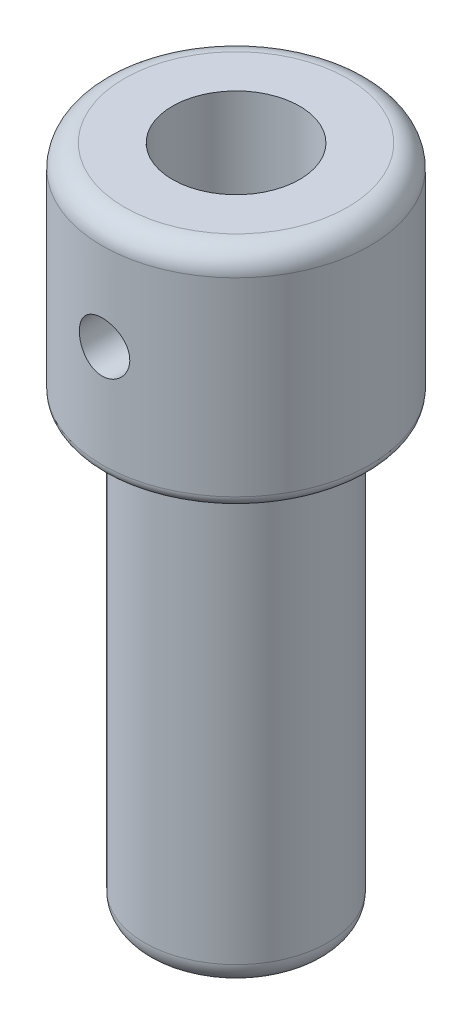
ISO-10303-21;
HEADER;
FILE_DESCRIPTION(('STEP AP214'),'2;1');
FILE_NAME('part.step','',(''),(''),'','','');
FILE_SCHEMA(('AUTOMOTIVE_DESIGN { 1 0 10303 214 1 1 1 1 }'));
ENDSEC;
DATA;
#1=APPLICATION_CONTEXT('core data for automotive mechanical design processes');
#2=APPLICATION_PROTOCOL_DEFINITION('international standard','automotive_design',2000,#1);
#3=PRODUCT_CONTEXT('',#1,'mechanical');
#4=PRODUCT('Part','Part','',(#3));
#5=PRODUCT_RELATED_PRODUCT_CATEGORY('part','',(#4));
#6=PRODUCT_DEFINITION_FORMATION('','',#4);
#7=PRODUCT_DEFINITION_CONTEXT('part definition',#1,'design');
#8=PRODUCT_DEFINITION('design','',#6,#7);
#9=PRODUCT_DEFINITION_SHAPE('','',#8);
#10=(LENGTH_UNIT() NAMED_UNIT(*) SI_UNIT(.MILLI.,.METRE.));
#11=(NAMED_UNIT(*) PLANE_ANGLE_UNIT() SI_UNIT($,.RADIAN.));
#12=(NAMED_UNIT(*) SI_UNIT($,.STERADIAN.) SOLID_ANGLE_UNIT());
#13=UNCERTAINTY_MEASURE_WITH_UNIT(LENGTH_MEASURE(1.E-05),#10,'distance_accuracy_value','');
#14=(GEOMETRIC_REPRESENTATION_CONTEXT(3) GLOBAL_UNCERTAINTY_ASSIGNED_CONTEXT((#13)) GLOBAL_UNIT_ASSIGNED_CONTEXT((#10,
#11,#12)) REPRESENTATION_CONTEXT('',''));
#15=CARTESIAN_POINT('',(0.,0.,0.));
#16=DIRECTION('',(0.,0.,1.));
#17=DIRECTION('',(1.,0.,0.));
#18=AXIS2_PLACEMENT_3D('',#15,#16,#17);
#19=CARTESIAN_POINT('',(0.,27.8833911171361,0.));
#20=DIRECTION('',(0.,1.,0.));
#21=DIRECTION('',(0.,0.,1.));
#22=AXIS2_PLACEMENT_3D('',#19,#20,#21);
#23=CYLINDRICAL_SURFACE('',#22,2.85);
#24=CARTESIAN_POINT('',(-1.1303,14.207956767553,-2.61628016657238));
#25=CARTESIAN_POINT('',(-1.13029345260006,14.1473595204045,-2.61628615758823));
#26=CARTESIAN_POINT('',(-1.12539796176125,14.0866739034662,-2.61841514923867));
#27=CARTESIAN_POINT('',(-1.10599719074433,13.9670406354449,-2.62666594018558));
#28=CARTESIAN_POINT('',(-1.09146710256743,13.9080978823915,-2.6327980464167));
#29=CARTESIAN_POINT('',(-1.05343662185008,13.7938825794678,-2.64824238541049));
#30=CARTESIAN_POINT('',(-1.02996966626684,13.7385972397041,-2.65754275073175));
#31=CARTESIAN_POINT('',(-0.974829067334243,13.6327616551994,-2.67825916114637));
#32=CARTESIAN_POINT('',(-0.94315731912611,13.5822103206651,-2.68967471750022));
#33=CARTESIAN_POINT('',(-0.870601296688737,13.4844066845974,-2.71405390199821));
#34=CARTESIAN_POINT('',(-0.829329791113889,13.4374537938542,-2.7270667752228));
#35=CARTESIAN_POINT('',(-0.739561241593753,13.3509176408861,-2.75276724838696));
#36=CARTESIAN_POINT('',(-0.691061705224281,13.3113369314261,-2.76545473434818));
#37=CARTESIAN_POINT('',(-0.585909079825502,13.2391909526268,-2.78966447553969));
#38=CARTESIAN_POINT('',(-0.529013276820995,13.2069560226321,-2.8011227276858));
#39=CARTESIAN_POINT('',(-0.41007101493985,13.1526421046209,-2.82098725876858));
#40=CARTESIAN_POINT('',(-0.348026630169997,13.1305590501424,-2.82939475943749));
#41=CARTESIAN_POINT('',(-0.223686802608242,13.0982408707284,-2.84186198756307));
#42=CARTESIAN_POINT('',(-0.161544393671202,13.0874910195282,-2.84610991073926));
#43=CARTESIAN_POINT('',(-0.0362022464437598,13.0764880962844,-2.85045890481045));
#44=CARTESIAN_POINT('',(0.0269970959328641,13.0762311780876,-2.8505614951646));
#45=CARTESIAN_POINT('',(0.14894280191952,13.0859367570211,-2.84672351510987));
#46=CARTESIAN_POINT('',(0.207742312429826,13.0953355759219,-2.84300595278716));
#47=CARTESIAN_POINT('',(0.32285017960443,13.1231285359758,-2.83224484413563));
#48=CARTESIAN_POINT('',(0.3791583534036,13.1415233362471,-2.82520105410183));
#49=CARTESIAN_POINT('',(0.488695083264103,13.1870129935552,-2.8083441160034));
#50=CARTESIAN_POINT('',(0.541864694625503,13.2142343511411,-2.79849096893217));
#51=CARTESIAN_POINT('',(0.643017939138199,13.2764868543251,-2.77699583915126));
#52=CARTESIAN_POINT('',(0.690999799633604,13.3115206569933,-2.7653532482582));
#53=CARTESIAN_POINT('',(0.78370941836785,13.3910453789027,-2.74057463765392));
#54=CARTESIAN_POINT('',(0.828026032225194,13.4360013875532,-2.72739072968969));
#55=CARTESIAN_POINT('',(0.908657773160785,13.5327626317893,-2.70159898880295));
#56=CARTESIAN_POINT('',(0.944970370584533,13.5845700244885,-2.6889913390008));
#57=CARTESIAN_POINT('',(1.00948153094452,13.6953712470871,-2.66545716991748));
#58=CARTESIAN_POINT('',(1.03743089233395,13.7545229246783,-2.65458608854393));
#59=CARTESIAN_POINT('',(1.08280941269767,13.8772392112616,-2.63640446660756));
#60=CARTESIAN_POINT('',(1.10024526707809,13.9408009829121,-2.62909166057208));
#61=CARTESIAN_POINT('',(1.12311075281383,14.0664365467872,-2.61940226123772));
#62=CARTESIAN_POINT('',(1.12920096451842,14.1283689457052,-2.61675460292483));
#63=CARTESIAN_POINT('',(1.13112604573816,14.2524138581021,-2.61592366023471));
#64=CARTESIAN_POINT('',(1.1269639435527,14.3145263129834,-2.61773905757246));
#65=CARTESIAN_POINT('',(1.10910367875456,14.4335397960088,-2.62535187637376));
#66=CARTESIAN_POINT('',(1.09594845961356,14.490538589223,-2.63092233882755));
#67=CARTESIAN_POINT('',(1.06117676870925,14.6014837463882,-2.6451378155093));
#68=CARTESIAN_POINT('',(1.03955844072125,14.6554294377254,-2.65378350419259));
#69=CARTESIAN_POINT('',(0.987503826129682,14.7611520661867,-2.67360042278488));
#70=CARTESIAN_POINT('',(0.956748280498782,14.8127549044529,-2.68485913351115));
#71=CARTESIAN_POINT('',(0.887620450132167,14.9102991539487,-2.70849826092059));
#72=CARTESIAN_POINT('',(0.84924510507705,14.9562382784211,-2.7208791272026));
#73=CARTESIAN_POINT('',(0.762686752231697,15.0446063215062,-2.74644975347201));
#74=CARTESIAN_POINT('',(0.71399490741265,15.0865404986826,-2.75963319912947));
#75=CARTESIAN_POINT('',(0.60994913624833,15.1617170350298,-2.78447828685408));
#76=CARTESIAN_POINT('',(0.55459497766097,15.1949590910729,-2.79613987584115));
#77=CARTESIAN_POINT('',(0.438636092047854,15.2516696894494,-2.81665729228926));
#78=CARTESIAN_POINT('',(0.378035304647506,15.2751454895477,-2.82551520212132));
#79=CARTESIAN_POINT('',(0.253307736784389,15.3114173331386,-2.83941250920415));
#80=CARTESIAN_POINT('',(0.189182853172556,15.3242190631049,-2.84445393950337));
#81=CARTESIAN_POINT('',(0.0636733211525488,15.3381123855514,-2.84993634234282));
#82=CARTESIAN_POINT('',(0.00237755620106384,15.3399039324471,-2.85065224962834));
#83=CARTESIAN_POINT('',(-0.119610230778455,15.3335677659018,-2.84814205272999));
#84=CARTESIAN_POINT('',(-0.180302340210167,15.3254415101812,-2.84491652785834));
#85=CARTESIAN_POINT('',(-0.29750802460962,15.2999997444868,-2.83502186178104));
#86=CARTESIAN_POINT('',(-0.354092223489288,15.2829653011713,-2.82845820866166));
#87=CARTESIAN_POINT('',(-0.463591313852398,15.2404837599666,-2.81258722939358));
#88=CARTESIAN_POINT('',(-0.51650552086019,15.2150350978517,-2.80327939312878));
#89=CARTESIAN_POINT('',(-0.619717100814278,15.1551857698337,-2.78232741592889));
#90=CARTESIAN_POINT('',(-0.669797290115329,15.1204408527963,-2.77059858084371));
#91=CARTESIAN_POINT('',(-0.763625088019747,15.0435037598042,-2.74622118141278));
#92=CARTESIAN_POINT('',(-0.807370126276554,15.0013085763923,-2.73357224686657));
#93=CARTESIAN_POINT('',(-0.890027710479454,14.90764427652,-2.70782897312818));
#94=CARTESIAN_POINT('',(-0.928486449468884,14.8557679882691,-2.69475412717537));
#95=CARTESIAN_POINT('',(-0.996182498280698,14.7458781476329,-2.67047181819971));
#96=CARTESIAN_POINT('',(-1.02541865937423,14.6878638319193,-2.65926458788181));
#97=CARTESIAN_POINT('',(-1.07150917231037,14.5725842768592,-2.64100887230388));
#98=CARTESIAN_POINT('',(-1.08923271334006,14.5157102864014,-2.63367939671218));
#99=CARTESIAN_POINT('',(-1.11550593728572,14.3996428704612,-2.62266224330814));
#100=CARTESIAN_POINT('',(-1.12408132532078,14.3404564310246,-2.61896436352176));
#101=CARTESIAN_POINT('',(-1.12951457954801,14.2566815834085,-2.61661869985514));
#102=CARTESIAN_POINT('',(-1.13030263307697,14.2323263214838,-2.61627775724868));
#103=CARTESIAN_POINT('',(-1.1303,14.207956767553,-2.61628016657238));
#104=B_SPLINE_CURVE_WITH_KNOTS('',3,(#24,#25,#26,#27,#28,#29,#30,#31,#32,#33,#34,#35,#36,#37,
#38,#39,#40,#41,#42,#43,#44,#45,#46,#47,#48,#49,#50,#51,#52,#53,#54,#55,#56,#57,#58,#59,#60,#61,
#62,#63,#64,#65,#66,#67,#68,#69,#70,#71,#72,#73,#74,#75,#76,#77,#78,#79,#80,#81,#82,#83,#84,#85,
#86,#87,#88,#89,#90,#91,#92,#93,#94,#95,#96,#97,#98,#99,#100,#101,#102,#103),.UNSPECIFIED.,.T.,
.F.,(4,2,2,2,2,2,2,2,2,2,2,2,2,2,2,2,2,2,2,2,2,2,2,2,2,2,2,2,2,2,2,2,2,2,2,2,2,2,2,4),(0.,
0.181716975656185,0.363903678435025,0.545415328812845,0.726885090992661,0.917602857506357,
1.10838654158053,1.30654526536695,1.50462454486106,1.69325899335997,1.88182429784737,
2.05997433361122,2.23813742404032,2.41897598989032,2.5998761543283,2.7924757333061,
2.98513609601993,3.18306800972907,3.380873739278,3.56675171469447,3.75257479258605,
3.92806848698283,4.10360069422464,4.28618218572826,4.4688371558088,4.66471276259825,
4.86059519940866,5.05633180558367,5.2519640688501,5.43501870938735,5.61804644776521,
5.79561976198589,5.97322610613686,6.15863738337789,6.34412367762097,6.54085612157854,
6.73761306010636,6.91689183719345,7.09566552657978,7.16874412085215),.UNSPECIFIED.);
#105=CARTESIAN_POINT('',(-1.1303,14.207956767553,-2.61628016657238));
#106=VERTEX_POINT('',#105);
#107=EDGE_CURVE('E73',#106,#106,#104,.T.);
#108=ORIENTED_EDGE('',*,*,#107,.F.);
#109=EDGE_LOOP('',(#108));
#110=FACE_BOUND('',#109,.T.);
#111=CARTESIAN_POINT('',(0.,-10.867124799104,0.));
#112=DIRECTION('',(0.,1.,0.));
#113=DIRECTION('',(0.,0.,1.));
#114=AXIS2_PLACEMENT_3D('',#111,#112,#113);
#115=CIRCLE('',#114,2.85);
#116=CARTESIAN_POINT('',(0.,-10.867124799104,2.85));
#117=VERTEX_POINT('',#116);
#118=EDGE_CURVE('E108',#117,#117,#115,.T.);
#119=ORIENTED_EDGE('',*,*,#118,.F.);
#120=EDGE_LOOP('',(#119));
#121=FACE_BOUND('',#120,.T.);
#122=CARTESIAN_POINT('',(0.,19.132875200896,0.));
#123=DIRECTION('',(0.,1.,0.));
#124=DIRECTION('',(0.,0.,1.));
#125=AXIS2_PLACEMENT_3D('',#122,#123,#124);
#126=CIRCLE('',#125,2.85);
#127=CARTESIAN_POINT('',(0.,19.132875200896,2.85));
#128=VERTEX_POINT('',#127);
#129=EDGE_CURVE('E110',#128,#128,#126,.T.);
#130=ORIENTED_EDGE('',*,*,#129,.T.);
#131=EDGE_LOOP('',(#130));
#132=FACE_BOUND('',#131,.T.);
#133=CARTESIAN_POINT('',(0.,13.077656767553,2.85));
#134=CARTESIAN_POINT('',(-0.0608074901773255,13.0776630687484,2.84999540717361));
#135=CARTESIAN_POINT('',(-0.12170401895874,13.0825915473681,2.84803157332203));
#136=CARTESIAN_POINT('',(-0.241779075214386,13.1021356497798,2.84036715899765));
#137=CARTESIAN_POINT('',(-0.300952858364843,13.1167757885902,2.83465712243533));
#138=CARTESIAN_POINT('',(-0.415658505000918,13.1551273542757,2.82011680696815));
#139=CARTESIAN_POINT('',(-0.471201282705017,13.1788099791171,2.81129644180019));
#140=CARTESIAN_POINT('',(-0.577479497217421,13.2344600579773,2.79140546168017));
#141=CARTESIAN_POINT('',(-0.62821635410214,13.2664250541876,2.78033551450547));
#142=CARTESIAN_POINT('',(-0.725866365661877,13.3393010047808,2.75649249571009));
#143=CARTESIAN_POINT('',(-0.772526878206848,13.3805332681854,2.74366717826313));
#144=CARTESIAN_POINT('',(-0.858483167241851,13.470094799743,2.71799980493592));
#145=CARTESIAN_POINT('',(-0.897775506554412,13.5184273614564,2.70515774404384));
#146=CARTESIAN_POINT('',(-0.969566525464378,13.6233773587061,2.68028899841203));
#147=CARTESIAN_POINT('',(-1.00169441300704,13.6802640947794,2.66832225649654));
#148=CARTESIAN_POINT('',(-1.0558132335576,13.7991801942983,2.64737734758081));
#149=CARTESIAN_POINT('',(-1.07780886559612,13.8612071580833,2.63839779575096));
#150=CARTESIAN_POINT('',(-1.11002079402964,13.9857402025369,2.6250043082653));
#151=CARTESIAN_POINT('',(-1.12072037427083,14.048100503069,2.62040396433028));
#152=CARTESIAN_POINT('',(-1.1315463603039,14.1738879939961,2.61574868363865));
#153=CARTESIAN_POINT('',(-1.13167785075336,14.2373146566362,2.61569156098812));
#154=CARTESIAN_POINT('',(-1.12173064439811,14.3588222559069,2.61996991346858));
#155=CARTESIAN_POINT('',(-1.11234775729079,14.4169727303552,2.62400604190015));
#156=CARTESIAN_POINT('',(-1.08479694085289,14.5307937316849,2.63551439098454));
#157=CARTESIAN_POINT('',(-1.06662750678942,14.5864638320078,2.64298720017255));
#158=CARTESIAN_POINT('',(-1.02167561073786,14.6950731194098,2.66068984260431));
#159=CARTESIAN_POINT('',(-0.994726440319279,14.7479343384592,2.67097236187942));
#160=CARTESIAN_POINT('',(-0.933096972754285,14.8485761854745,2.69312093396432));
#161=CARTESIAN_POINT('',(-0.898413803098735,14.8963549159732,2.70498757447865));
#162=CARTESIAN_POINT('',(-0.819206791654082,14.9892904327284,2.73006423834238));
#163=CARTESIAN_POINT('',(-0.774135945835915,15.0339731846202,2.7433078729725));
#164=CARTESIAN_POINT('',(-0.676997914315145,15.1152963093423,2.76887958021833));
#165=CARTESIAN_POINT('',(-0.624929385031422,15.151935134142,2.78120747630129));
#166=CARTESIAN_POINT('',(-0.513948433470195,15.2167382574043,2.8038581708288));
#167=CARTESIAN_POINT('',(-0.454924167479125,15.2447270810821,2.81413811310026));
#168=CARTESIAN_POINT('',(-0.332494133954596,15.2902156618742,2.83121151543585));
#169=CARTESIAN_POINT('',(-0.269090570769267,15.3077206537949,2.83800671526403));
#170=CARTESIAN_POINT('',(-0.143677420716787,15.330792602352,2.84702949040508));
#171=CARTESIAN_POINT('',(-0.0818025104643576,15.3369967802482,2.84950054106954));
#172=CARTESIAN_POINT('',(0.0421475010854392,15.3391689180957,2.85036151708329));
#173=CARTESIAN_POINT('',(0.104222547580404,15.3351394759652,2.84875247820882));
#174=CARTESIAN_POINT('',(0.223941293107055,15.3174295976768,2.84179365203397));
#175=CARTESIAN_POINT('',(0.281659786441459,15.3041816808885,2.83661160172229));
#176=CARTESIAN_POINT('',(0.394003182883948,15.2689967689373,2.82320107652625));
#177=CARTESIAN_POINT('',(0.448627686622372,15.247058654959,2.81497220938979));
#178=CARTESIAN_POINT('',(0.555103317684441,15.194401637323,2.79595702197941));
#179=CARTESIAN_POINT('',(0.606819310170456,15.1634356538699,2.78510044442673));
#180=CARTESIAN_POINT('',(0.704501711258952,15.0938766813523,2.76201026134428));
#181=CARTESIAN_POINT('',(0.750465825620841,15.0552806646456,2.74977611001727));
#182=CARTESIAN_POINT('',(0.838468771170681,14.9686173745911,2.72428045643214));
#183=CARTESIAN_POINT('',(0.880059076122483,14.92009790501,2.71100381933433));
#184=CARTESIAN_POINT('',(0.954614470450029,14.8165295800304,2.6856593144646));
#185=CARTESIAN_POINT('',(0.987578239910047,14.7614797273117,2.67359163184467));
#186=CARTESIAN_POINT('',(1.04412658812304,14.6456391985278,2.65202341673373));
#187=CARTESIAN_POINT('',(1.06762563693942,14.5848020554289,2.64254653258578));
#188=CARTESIAN_POINT('',(1.10386749904738,14.4595459869256,2.62761642025123));
#189=CARTESIAN_POINT('',(1.1166180626714,14.3951296781111,2.62216029320418));
#190=CARTESIAN_POINT('',(1.13026658953869,14.2694664556327,2.61630416042592));
#191=CARTESIAN_POINT('',(1.13194100449719,14.2083187574168,2.61557301861382));
#192=CARTESIAN_POINT('',(1.12542175708809,14.086657922589,2.61838469640648));
#193=CARTESIAN_POINT('',(1.11722929527908,14.0261447096793,2.62192699603758));
#194=CARTESIAN_POINT('',(1.09183901376176,13.9098368830376,2.63259656992956));
#195=CARTESIAN_POINT('',(1.07499725370773,13.8539503211319,2.63958168897616));
#196=CARTESIAN_POINT('',(1.03311689699473,13.7457726181341,2.6562520251346));
#197=CARTESIAN_POINT('',(1.00807612998347,13.6934824334756,2.66593795707553));
#198=CARTESIAN_POINT('',(0.948869921275455,13.5907574697891,2.6875996422432));
#199=CARTESIAN_POINT('',(0.914268215995947,13.5405952543372,2.69967397493624));
#200=CARTESIAN_POINT('',(0.837562587574521,13.4465421621369,2.72444704457689));
#201=CARTESIAN_POINT('',(0.795455976972472,13.4026535421028,2.73714600401612));
#202=CARTESIAN_POINT('',(0.701758941402807,13.3195438073351,2.76270453999705));
#203=CARTESIAN_POINT('',(0.6497364035738,13.2807952453674,2.77552322426576));
#204=CARTESIAN_POINT('',(0.539453232251982,13.2125834086442,2.79904653565289));
#205=CARTESIAN_POINT('',(0.481191822549223,13.183121291065,2.8097508992455));
#206=CARTESIAN_POINT('',(0.365238679776311,13.1366294573683,2.82705511944058));
#207=CARTESIAN_POINT('',(0.307927595281227,13.1187494402197,2.83392849184325));
#208=CARTESIAN_POINT('',(0.190996183608853,13.0923086550131,2.84419401296488));
#209=CARTESIAN_POINT('',(0.131382633374208,13.0837224184462,2.84759567402874));
#210=CARTESIAN_POINT('',(0.0477011594602018,13.0784095112854,2.8497020110239));
#211=CARTESIAN_POINT('',(0.0238574327439071,13.0776542953191,2.85000180196628));
#212=CARTESIAN_POINT('',(0.,13.077656767553,2.85));
#213=B_SPLINE_CURVE_WITH_KNOTS('',3,(#133,#134,#135,#136,#137,#138,#139,#140,#141,#142,#143,
#144,#145,#146,#147,#148,#149,#150,#151,#152,#153,#154,#155,#156,#157,#158,#159,#160,#161,#162,
#163,#164,#165,#166,#167,#168,#169,#170,#171,#172,#173,#174,#175,#176,#177,#178,#179,#180,#181,
#182,#183,#184,#185,#186,#187,#188,#189,#190,#191,#192,#193,#194,#195,#196,#197,#198,#199,#200,
#201,#202,#203,#204,#205,#206,#207,#208,#209,#210,#211,#212),.UNSPECIFIED.,.T.,.F.,(4,2,2,2,2,2,
2,2,2,2,2,2,2,2,2,2,2,2,2,2,2,2,2,2,2,2,2,2,2,2,2,2,2,2,2,2,2,2,2,4),(0.,0.18235103647887,
0.365164139898366,0.547399741978617,0.729581327129752,0.919471809889442,1.10945065544731,
1.30771063280494,1.50587857044083,1.69517432753335,1.88437900762991,2.06067832241764,
2.2370078398976,2.41690232727703,2.59686374145579,2.79048030117432,2.98413408924157,
3.18149147161195,3.37875022678966,3.56449421800991,3.75019106076687,3.92771585731982,
4.1052635166521,4.28821859506783,4.47124641738565,4.66615596565339,4.86109531892948,
5.0577587563263,5.25428026544829,5.43686454500736,5.61942661075088,5.79501290601742,
5.97064571821315,6.1562200901882,6.3418610491987,6.53927563570051,6.73671481215973,
6.91720057574005,7.09719047731524,7.16873474884971),.UNSPECIFIED.);
#214=CARTESIAN_POINT('',(0.,13.077656767553,2.85));
#215=VERTEX_POINT('',#214);
#216=EDGE_CURVE('E78',#215,#215,#213,.T.);
#217=ORIENTED_EDGE('',*,*,#216,.F.);
#218=EDGE_LOOP('',(#217));
#219=FACE_BOUND('',#218,.T.);
#220=ADVANCED_FACE('F33',(#110,#121,#132,#219),#23,.F.);
#221=CARTESIAN_POINT('',(0.,27.8833911171361,0.));
#222=DIRECTION('',(0.,1.,0.));
#223=DIRECTION('',(0.,0.,1.));
#224=AXIS2_PLACEMENT_3D('',#221,#222,#223);
#225=CYLINDRICAL_SURFACE('',#224,6.);
#226=CARTESIAN_POINT('',(-1.1303,14.207956767553,-5.89257345393335));
#227=CARTESIAN_POINT('',(-1.13029759371886,14.2708388443507,-5.89257467389349));
#228=CARTESIAN_POINT('',(-1.12503470923862,14.3337520765433,-5.89359094692568));
#229=CARTESIAN_POINT('',(-1.10413664888009,14.4578041412641,-5.89754110597075));
#230=CARTESIAN_POINT('',(-1.08849270845028,14.5189414288273,-5.90047661232925));
#231=CARTESIAN_POINT('',(-1.0473303443427,14.6376287420455,-5.90792124227976));
#232=CARTESIAN_POINT('',(-1.02182116166712,14.6951820664784,-5.91242889282098));
#233=CARTESIAN_POINT('',(-0.961676957570338,14.8051887388032,-5.92250816709464));
#234=CARTESIAN_POINT('',(-0.927042634263309,14.8576424764163,-5.92807970942562));
#235=CARTESIAN_POINT('',(-0.849167546629499,14.9566237480183,-5.93973717031582));
#236=CARTESIAN_POINT('',(-0.805834284110569,15.003077919844,-5.94582817339823));
#237=CARTESIAN_POINT('',(-0.71199129427523,15.0881021235051,-5.95779335599509));
#238=CARTESIAN_POINT('',(-0.661481094038662,15.1266716353767,-5.96366752118898));
#239=CARTESIAN_POINT('',(-0.55423589821718,15.195113034438,-5.97459166076109));
#240=CARTESIAN_POINT('',(-0.497455997167567,15.2249157155131,-5.97963494574712));
#241=CARTESIAN_POINT('',(-0.379584245485869,15.274531542122,-5.98827215676677));
#242=CARTESIAN_POINT('',(-0.318492753200837,15.29434551673,-5.99186620308392));
#243=CARTESIAN_POINT('',(-0.194492274556963,15.3231945274959,-5.99716407192991));
#244=CARTESIAN_POINT('',(-0.131613005230441,15.3323532491812,-5.99888956786352));
#245=CARTESIAN_POINT('',(-0.0051882759389024,15.3400171921361,-6.00033063220662));
#246=CARTESIAN_POINT('',(0.0583571263164807,15.3385233287865,-6.00004637331517));
#247=CARTESIAN_POINT('',(0.18346196079908,15.3250192931738,-5.99751688360689));
#248=CARTESIAN_POINT('',(0.245036343694403,15.3131423032652,-5.99529648816132));
#249=CARTESIAN_POINT('',(0.365302250254909,15.2794198393961,-5.98917207750207));
#250=CARTESIAN_POINT('',(0.423993668038547,15.2575739996163,-5.9852680005039));
#251=CARTESIAN_POINT('',(0.537213480987694,15.2044073022617,-5.97617342431387));
#252=CARTESIAN_POINT('',(0.591716308844505,15.1730332782528,-5.97097573704647));
#253=CARTESIAN_POINT('',(0.694733396109534,15.1017399924976,-5.95986862362393));
#254=CARTESIAN_POINT('',(0.743247040170656,15.0618198538475,-5.95395912445808));
#255=CARTESIAN_POINT('',(0.833697817343187,14.9738338462739,-5.94197486705887));
#256=CARTESIAN_POINT('',(0.875521533300508,14.9256514582844,-5.93589896668325));
#257=CARTESIAN_POINT('',(0.950511740950543,14.8228966258741,-5.92435408642993));
#258=CARTESIAN_POINT('',(0.983678103585473,14.7683240862111,-5.91888511560061));
#259=CARTESIAN_POINT('',(1.0404449396288,14.6541868241688,-5.90917161079096));
#260=CARTESIAN_POINT('',(1.06402880069238,14.594613646461,-5.90492920684266));
#261=CARTESIAN_POINT('',(1.10082063214817,14.4722524931995,-5.89818169416891));
#262=CARTESIAN_POINT('',(1.11402979021293,14.4094648865032,-5.89567638658845));
#263=CARTESIAN_POINT('',(1.12953139095561,14.2834802790257,-5.8927261013338));
#264=CARTESIAN_POINT('',(1.13198683750925,14.2203040343097,-5.89225036251723));
#265=CARTESIAN_POINT('',(1.12634838078183,14.0944442801849,-5.8933307455046));
#266=CARTESIAN_POINT('',(1.11825500441689,14.0317607463223,-5.8948867658217));
#267=CARTESIAN_POINT('',(1.09188861826389,13.9092024850445,-5.89982667821748));
#268=CARTESIAN_POINT('',(1.07370117440431,13.8493086742578,-5.90319519877196));
#269=CARTESIAN_POINT('',(1.02775376593798,13.7334185108507,-5.91136730426489));
#270=CARTESIAN_POINT('',(0.999993090020273,13.6774224482128,-5.91617099583597));
#271=CARTESIAN_POINT('',(0.93531249989419,13.5701995304521,-5.92674217299624));
#272=CARTESIAN_POINT('',(0.898289681187595,13.5190358130629,-5.9325202315263));
#273=CARTESIAN_POINT('',(0.816274400536103,13.4235880798529,-5.94435940963402));
#274=CARTESIAN_POINT('',(0.771281214942673,13.3793046893993,-5.95042055487695));
#275=CARTESIAN_POINT('',(0.67387411161694,13.2982650515854,-5.96224188424027));
#276=CARTESIAN_POINT('',(0.621368228101326,13.2616184714975,-5.96799690179677));
#277=CARTESIAN_POINT('',(0.510850331225583,13.1976669707001,-5.97847040596565));
#278=CARTESIAN_POINT('',(0.452838531357308,13.1703616879707,-5.98318893274444));
#279=CARTESIAN_POINT('',(0.333257542608679,13.1260317502195,-5.99103559735171));
#280=CARTESIAN_POINT('',(0.271708829044421,13.1089533949851,-5.99417202859797));
#281=CARTESIAN_POINT('',(0.146551941837028,13.0853908101777,-5.99853650319357));
#282=CARTESIAN_POINT('',(0.0829439877660658,13.0789054548665,-5.99976474932868));
#283=CARTESIAN_POINT('',(-0.0434743600565885,13.076752461841,-6.00017037890725));
#284=CARTESIAN_POINT('',(-0.106281892954294,13.0809192404305,-5.99937915462033));
#285=CARTESIAN_POINT('',(-0.23028491409703,13.0995893773522,-5.99590003281552));
#286=CARTESIAN_POINT('',(-0.291480418106064,13.1140926345651,-5.99321215385212));
#287=CARTESIAN_POINT('',(-0.410433670936893,13.1529539939639,-5.98624178242548));
#288=CARTESIAN_POINT('',(-0.468197408222457,13.1772943142014,-5.98196216836588));
#289=CARTESIAN_POINT('',(-0.578845573261696,13.2351189451301,-5.97227143302769));
#290=CARTESIAN_POINT('',(-0.631729669662803,13.2686038761767,-5.96686023499014));
#291=CARTESIAN_POINT('',(-0.731942045043275,13.3443363853837,-5.95540465399448));
#292=CARTESIAN_POINT('',(-0.779179073977161,13.3867035107906,-5.94935225635727));
#293=CARTESIAN_POINT('',(-0.865930542839265,13.4787498639811,-5.93734679556969));
#294=CARTESIAN_POINT('',(-0.905443163108347,13.5284308098801,-5.93139375612675));
#295=CARTESIAN_POINT('',(-0.975971748865723,13.6342506426229,-5.9202001498155));
#296=CARTESIAN_POINT('',(-1.00690477455703,13.6904455929941,-5.91496676872234));
#297=CARTESIAN_POINT('',(-1.05884162530713,13.8073153497527,-5.90589156858521));
#298=CARTESIAN_POINT('',(-1.0798547978091,13.8679858762223,-5.9020484403123));
#299=CARTESIAN_POINT('',(-1.10709830437237,13.9753533572073,-5.89698787021498));
#300=CARTESIAN_POINT('',(-1.11578398340493,14.0214227964166,-5.895342324396));
#301=CARTESIAN_POINT('',(-1.12738564742696,14.1143079995331,-5.89313467695352));
#302=CARTESIAN_POINT('',(-1.13030179213903,14.1611237427436,-5.89257254533703));
#303=CARTESIAN_POINT('',(-1.1303,14.207956767553,-5.89257345393335));
#304=B_SPLINE_CURVE_WITH_KNOTS('',3,(#226,#227,#228,#229,#230,#231,#232,#233,#234,#235,#236,
#237,#238,#239,#240,#241,#242,#243,#244,#245,#246,#247,#248,#249,#250,#251,#252,#253,#254,#255,
#256,#257,#258,#259,#260,#261,#262,#263,#264,#265,#266,#267,#268,#269,#270,#271,#272,#273,#274,
#275,#276,#277,#278,#279,#280,#281,#282,#283,#284,#285,#286,#287,#288,#289,#290,#291,#292,#293,
#294,#295,#296,#297,#298,#299,#300,#301,#302,#303),.UNSPECIFIED.,.T.,.F.,(4,2,2,2,2,2,2,2,2,2,2,
2,2,2,2,2,2,2,2,2,2,2,2,2,2,2,2,2,2,2,2,2,2,2,2,2,2,2,4),(0.,0.188474837809353,
0.377109004567857,0.565566899632644,0.754010381007904,0.944575275358041,1.1351527327001,
1.3271965620485,1.51922444891121,1.70900031705595,1.89875987788,2.08612056256102,
2.27348812322843,2.46192101060149,2.65037324206291,2.84174242061811,3.03311445180864,
3.22481684677292,3.41649729288066,3.6052619786998,3.79401723604097,3.98119635589329,
4.1683893865392,4.35776249296093,4.54715280183706,4.73909944981968,4.93103865811116,
5.12196097490292,5.31286300069767,5.50081562562075,5.68876641187544,5.87637895810663,
6.06400423482778,6.25433874077484,6.44471803043099,6.63687822772841,6.82885698991455,
6.96923230153583,7.10960372698161),.UNSPECIFIED.);
#305=CARTESIAN_POINT('',(-1.1303,14.207956767553,-5.89257345393335));
#306=VERTEX_POINT('',#305);
#307=EDGE_CURVE('E53',#306,#306,#304,.T.);
#308=ORIENTED_EDGE('',*,*,#307,.F.);
#309=EDGE_LOOP('',(#308));
#310=FACE_BOUND('',#309,.T.);
#311=CARTESIAN_POINT('',(0.,18.132875200896,0.));
#312=DIRECTION('',(0.,1.,0.));
#313=DIRECTION('',(0.,0.,1.));
#314=AXIS2_PLACEMENT_3D('',#311,#312,#313);
#315=CIRCLE('',#314,6.);
#316=CARTESIAN_POINT('',(0.,18.132875200896,6.));
#317=VERTEX_POINT('',#316);
#318=EDGE_CURVE('E118',#317,#317,#315,.T.);
#319=ORIENTED_EDGE('',*,*,#318,.F.);
#320=EDGE_LOOP('',(#319));
#321=FACE_BOUND('',#320,.T.);
#322=CARTESIAN_POINT('',(0.,9.632875200896,0.));
#323=DIRECTION('',(0.,1.,0.));
#324=DIRECTION('',(0.,0.,1.));
#325=AXIS2_PLACEMENT_3D('',#322,#323,#324);
#326=CIRCLE('',#325,6.);
#327=CARTESIAN_POINT('',(0.,9.632875200896,6.));
#328=VERTEX_POINT('',#327);
#329=EDGE_CURVE('E121',#328,#328,#326,.T.);
#330=ORIENTED_EDGE('',*,*,#329,.T.);
#331=EDGE_LOOP('',(#330));
#332=FACE_BOUND('',#331,.T.);
#333=CARTESIAN_POINT('',(0.,13.077656767553,6.));
#334=CARTESIAN_POINT('',(0.0628932389543182,13.0776591649656,5.99999885914656));
#335=CARTESIAN_POINT('',(0.125817608574759,13.0829238548348,5.99900090415921));
#336=CARTESIAN_POINT('',(0.249892801377631,13.1038297361096,5.99511605807622));
#337=CARTESIAN_POINT('',(0.311042088640952,13.1194796496645,5.99222757923038));
#338=CARTESIAN_POINT('',(0.429754809699452,13.160659477844,5.98488475872163));
#339=CARTESIAN_POINT('',(0.48732144062292,13.1861804325084,5.9804318374407));
#340=CARTESIAN_POINT('',(0.597350528127393,13.2463523827006,5.97044623572366));
#341=CARTESIAN_POINT('',(0.649813389872817,13.2810026526833,5.96491364110277));
#342=CARTESIAN_POINT('',(0.748784854836823,13.3588940570542,5.95330448567587));
#343=CARTESIAN_POINT('',(0.795222870645714,13.4022241105436,5.94722268565042));
#344=CARTESIAN_POINT('',(0.880215751140434,13.4960538343497,5.93523940886893));
#345=CARTESIAN_POINT('',(0.91877004623113,13.546554022259,5.92933794516827));
#346=CARTESIAN_POINT('',(0.987195130470647,13.6537899545357,5.91833258077071));
#347=CARTESIAN_POINT('',(1.01699402711877,13.7105723262345,5.91323543414541));
#348=CARTESIAN_POINT('',(1.0666021820974,13.8284494270073,5.90448967867743));
#349=CARTESIAN_POINT('',(1.08641231044629,13.8895437799807,5.90084094368446));
#350=CARTESIAN_POINT('',(1.11525387373646,14.0135550383663,5.89545788230474));
#351=CARTESIAN_POINT('',(1.1244084604995,14.0764423345707,5.89370170062416));
#352=CARTESIAN_POINT('',(1.13206134973846,14.2028829301222,5.89223670105796));
#353=CARTESIAN_POINT('',(1.13056061697115,14.2664361686531,5.89252769781616));
#354=CARTESIAN_POINT('',(1.11704530785813,14.3915117779774,5.89510428103397));
#355=CARTESIAN_POINT('',(1.10517084825011,14.4530499179323,5.89736328472168));
#356=CARTESIAN_POINT('',(1.07146585539949,14.5732446623993,5.90357958723083));
#357=CARTESIAN_POINT('',(1.04963489546902,14.6319011432979,5.90753695883574));
#358=CARTESIAN_POINT('',(0.996499796046214,14.7450770776931,5.91673184753736));
#359=CARTESIAN_POINT('',(0.965139150760274,14.7995693593448,5.92197696361083));
#360=CARTESIAN_POINT('',(0.893874850648502,14.9025709453236,5.93315133362835));
#361=CARTESIAN_POINT('',(0.853970320889444,14.9510796361009,5.93908065760975));
#362=CARTESIAN_POINT('',(0.765995908470758,15.0415465401487,5.95107113967342));
#363=CARTESIAN_POINT('',(0.717806197395634,15.0833882345658,5.95713289420429));
#364=CARTESIAN_POINT('',(0.615030131259768,15.1584112994508,5.96861854216981));
#365=CARTESIAN_POINT('',(0.560443710918559,15.1915925815251,5.97404242909369));
#366=CARTESIAN_POINT('',(0.446301647818589,15.2483703965751,5.98365232272321));
#367=CARTESIAN_POINT('',(0.386739794573155,15.2719547281874,5.98783675178132));
#368=CARTESIAN_POINT('',(0.264403404672845,15.3087509203316,5.9944840808282));
#369=CARTESIAN_POINT('',(0.201629213346322,15.3219638933065,5.99694716544707));
#370=CARTESIAN_POINT('',(0.0756524506731163,15.3374799263952,5.99984889762712));
#371=CARTESIAN_POINT('',(0.0124702011921076,15.3399426222571,6.00031716459693));
#372=CARTESIAN_POINT('',(-0.113403261369604,15.3343165191276,5.9992583494535));
#373=CARTESIAN_POINT('',(-0.176094498657884,15.3262282436501,5.99773136633977));
#374=CARTESIAN_POINT('',(-0.298699426079426,15.2998625070983,5.99287207629882));
#375=CARTESIAN_POINT('',(-0.358631120955033,15.2816658992743,5.98955410082076));
#376=CARTESIAN_POINT('',(-0.474593032819807,15.235687587309,5.98148334422547));
#377=CARTESIAN_POINT('',(-0.530622982655254,15.2079052276023,5.97673046497858));
#378=CARTESIAN_POINT('',(-0.637871650270744,15.1431912771293,5.96624323169423));
#379=CARTESIAN_POINT('',(-0.6890305483775,15.1061622419552,5.96049863963467));
#380=CARTESIAN_POINT('',(-0.784465696351685,15.0241378239257,5.94869145956335));
#381=CARTESIAN_POINT('',(-0.828741296308209,14.9791416896854,5.94262884159622));
#382=CARTESIAN_POINT('',(-0.909760267147439,14.8817373710073,5.93077053368272));
#383=CARTESIAN_POINT('',(-0.94639465153901,14.8292378702331,5.92497951432248));
#384=CARTESIAN_POINT('',(-1.01032478129957,14.718736361652,5.9144144340432));
#385=CARTESIAN_POINT('',(-1.03762087572806,14.6607345596212,5.90964033511482));
#386=CARTESIAN_POINT('',(-1.08194546920885,14.541150331211,5.90168636797919));
#387=CARTESIAN_POINT('',(-1.09902372738675,14.4795868853757,5.89849878668457));
#388=CARTESIAN_POINT('',(-1.12258114067708,14.3543986177292,5.89406123315332));
#389=CARTESIAN_POINT('',(-1.12906150422883,14.2907740317863,5.89281104000423));
#390=CARTESIAN_POINT('',(-1.13119844276243,14.1643614189092,5.89240109183995));
#391=CARTESIAN_POINT('',(-1.12702695407055,14.1015763418733,5.89320812977321));
#392=CARTESIAN_POINT('',(-1.10835523796855,13.9776194842877,5.89674803913204));
#393=CARTESIAN_POINT('',(-1.09385507365316,13.9164476938853,5.89948089879334));
#394=CARTESIAN_POINT('',(-1.05501044538576,13.7975475034424,5.90655048330915));
#395=CARTESIAN_POINT('',(-1.03068476958113,13.7398127715308,5.91088414579599));
#396=CARTESIAN_POINT('',(-0.972898504643038,13.629216613652,5.92066917857876));
#397=CARTESIAN_POINT('',(-0.939437261735798,13.5763555368232,5.92612062886062));
#398=CARTESIAN_POINT('',(-0.863732678683238,13.4761463173841,5.93762997424891));
#399=CARTESIAN_POINT('',(-0.821364274874368,13.4288935493228,5.94369578843317));
#400=CARTESIAN_POINT('',(-0.729308649918435,13.3421109182605,5.95569131672071));
#401=CARTESIAN_POINT('',(-0.67961974978212,13.302582831802,5.96162099924));
#402=CARTESIAN_POINT('',(-0.573791709844677,13.232035293877,5.97273947359168));
#403=CARTESIAN_POINT('',(-0.517597980411427,13.2010965562722,5.97792103118148));
#404=CARTESIAN_POINT('',(-0.400730357210414,13.149148700625,5.98688874962761));
#405=CARTESIAN_POINT('',(-0.340060721803639,13.1281302817742,5.99067621677883));
#406=CARTESIAN_POINT('',(-0.232679685327057,13.1008737813683,5.99565934229762));
#407=CARTESIAN_POINT('',(-0.186594944792629,13.09218232509,5.99727787334231));
#408=CARTESIAN_POINT('',(-0.0936792142890149,13.0805729998672,5.99944861332115));
#409=CARTESIAN_POINT('',(-0.0468482436314917,13.0776549817559,6.00000084980486));
#410=CARTESIAN_POINT('',(0.,13.077656767553,6.));
#411=B_SPLINE_CURVE_WITH_KNOTS('',3,(#333,#334,#335,#336,#337,#338,#339,#340,#341,#342,#343,
#344,#345,#346,#347,#348,#349,#350,#351,#352,#353,#354,#355,#356,#357,#358,#359,#360,#361,#362,
#363,#364,#365,#366,#367,#368,#369,#370,#371,#372,#373,#374,#375,#376,#377,#378,#379,#380,#381,
#382,#383,#384,#385,#386,#387,#388,#389,#390,#391,#392,#393,#394,#395,#396,#397,#398,#399,#400,
#401,#402,#403,#404,#405,#406,#407,#408,#409,#410),.UNSPECIFIED.,.T.,.F.,(4,2,2,2,2,2,2,2,2,2,2,
2,2,2,2,2,2,2,2,2,2,2,2,2,2,2,2,2,2,2,2,2,2,2,2,2,2,2,4),(0.,0.188508385793131,
0.377175293231209,0.565671347793634,0.754152426302127,0.944673411867236,1.13520815762464,
1.3272662999546,1.51930771119367,1.70910683775544,1.89888877969347,2.08614631334315,
2.27341187270682,2.46181022856588,2.65022788652201,2.84164377789371,3.03306162289608,
3.22472207786876,3.41636197232898,3.60514622354789,3.79392110810435,3.98120734446386,
4.16850639178823,4.35786933820066,4.54725015313999,4.73917094058652,4.93108455336866,
5.12205580718325,5.31300528372249,5.50089210988302,5.68877778831027,5.87630588358286,
6.06384740255429,6.25422281339352,6.44464195587329,6.63679415938731,6.8287658507133,
6.96918658768789,7.1096036966021),.UNSPECIFIED.);
#412=CARTESIAN_POINT('',(0.,13.077656767553,6.));
#413=VERTEX_POINT('',#412);
#414=EDGE_CURVE('E37',#413,#413,#411,.T.);
#415=ORIENTED_EDGE('',*,*,#414,.F.);
#416=EDGE_LOOP('',(#415));
#417=FACE_BOUND('',#416,.T.);
#418=ADVANCED_FACE('F57',(#310,#321,#332,#417),#225,.T.);
#419=CARTESIAN_POINT('',(0.,8.132875200896,0.));
#420=DIRECTION('',(0.,1.,0.));
#421=DIRECTION('',(0.,0.,1.));
#422=AXIS2_PLACEMENT_3D('',#419,#420,#421);
#423=TOROIDAL_SURFACE('',#422,5.1,1.);
#424=CARTESIAN_POINT('',(0.,9.132875200896,0.));
#425=DIRECTION('',(0.,1.,0.));
#426=DIRECTION('',(0.,0.,1.));
#427=AXIS2_PLACEMENT_3D('',#424,#425,#426);
#428=CIRCLE('',#427,5.1);
#429=CARTESIAN_POINT('',(0.,9.132875200896,5.1));
#430=VERTEX_POINT('',#429);
#431=EDGE_CURVE('E126',#430,#430,#428,.T.);
#432=ORIENTED_EDGE('',*,*,#431,.F.);
#433=EDGE_LOOP('',(#432));
#434=FACE_BOUND('',#433,.T.);
#435=CARTESIAN_POINT('',(0.,8.132875200896,0.));
#436=DIRECTION('',(0.,1.,0.));
#437=DIRECTION('',(0.,0.,1.));
#438=AXIS2_PLACEMENT_3D('',#435,#436,#437);
#439=CIRCLE('',#438,4.1);
#440=CARTESIAN_POINT('',(0.,8.132875200896,4.1));
#441=VERTEX_POINT('',#440);
#442=EDGE_CURVE('E10',#441,#441,#439,.T.);
#443=ORIENTED_EDGE('',*,*,#442,.T.);
#444=EDGE_LOOP('',(#443));
#445=FACE_BOUND('',#444,.T.);
#446=ADVANCED_FACE('F35',(#434,#445),#423,.F.);
#447=CARTESIAN_POINT('',(0.,27.8833911171361,0.));
#448=DIRECTION('',(0.,1.,0.));
#449=DIRECTION('',(0.,0.,1.));
#450=AXIS2_PLACEMENT_3D('',#447,#448,#449);
#451=CYLINDRICAL_SURFACE('',#450,4.1);
#452=ORIENTED_EDGE('',*,*,#442,.F.);
#453=EDGE_LOOP('',(#452));
#454=FACE_BOUND('',#453,.T.);
#455=CARTESIAN_POINT('',(0.,-9.867124799104,0.));
#456=DIRECTION('',(0.,1.,0.));
#457=DIRECTION('',(0.,0.,1.));
#458=AXIS2_PLACEMENT_3D('',#455,#456,#457);
#459=CIRCLE('',#458,4.1);
#460=CARTESIAN_POINT('',(0.,-9.867124799104,4.1));
#461=VERTEX_POINT('',#460);
#462=EDGE_CURVE('E45',#461,#461,#459,.T.);
#463=ORIENTED_EDGE('',*,*,#462,.T.);
#464=EDGE_LOOP('',(#463));
#465=FACE_BOUND('',#464,.T.);
#466=ADVANCED_FACE('F95',(#454,#465),#451,.T.);
#467=CARTESIAN_POINT('',(0.,-9.867124799104,0.));
#468=DIRECTION('',(0.,1.,0.));
#469=DIRECTION('',(0.,0.,1.));
#470=AXIS2_PLACEMENT_3D('',#467,#468,#469);
#471=TOROIDAL_SURFACE('',#470,3.1,1.);
#472=ORIENTED_EDGE('',*,*,#462,.F.);
#473=EDGE_LOOP('',(#472));
#474=FACE_BOUND('',#473,.T.);
#475=CARTESIAN_POINT('',(0.,-10.867124799104,0.));
#476=DIRECTION('',(0.,1.,0.));
#477=DIRECTION('',(0.,0.,1.));
#478=AXIS2_PLACEMENT_3D('',#475,#476,#477);
#479=CIRCLE('',#478,3.1);
#480=CARTESIAN_POINT('',(0.,-10.867124799104,3.1));
#481=VERTEX_POINT('',#480);
#482=EDGE_CURVE('E50',#481,#481,#479,.T.);
#483=ORIENTED_EDGE('',*,*,#482,.T.);
#484=EDGE_LOOP('',(#483));
#485=FACE_BOUND('',#484,.T.);
#486=ADVANCED_FACE('F92',(#474,#485),#471,.T.);
#487=CARTESIAN_POINT('',(3.1,-10.867124799104,0.));
#488=DIRECTION('',(0.,1.,0.));
#489=DIRECTION('',(0.,0.,1.));
#490=AXIS2_PLACEMENT_3D('',#487,#488,#489);
#491=PLANE('',#490);
#492=ORIENTED_EDGE('',*,*,#482,.F.);
#493=EDGE_LOOP('',(#492));
#494=FACE_BOUND('',#493,.T.);
#495=ORIENTED_EDGE('',*,*,#118,.T.);
#496=EDGE_LOOP('',(#495));
#497=FACE_BOUND('',#496,.T.);
#498=ADVANCED_FACE('F88',(#494,#497),#491,.F.);
#499=CARTESIAN_POINT('',(2.85,19.132875200896,0.));
#500=DIRECTION('',(0.,-1.,0.));
#501=DIRECTION('',(0.,0.,-1.));
#502=AXIS2_PLACEMENT_3D('',#499,#500,#501);
#503=PLANE('',#502);
#504=ORIENTED_EDGE('',*,*,#129,.F.);
#505=EDGE_LOOP('',(#504));
#506=FACE_BOUND('',#505,.T.);
#507=CARTESIAN_POINT('',(0.,19.132875200896,0.));
#508=DIRECTION('',(0.,1.,0.));
#509=DIRECTION('',(0.,0.,1.));
#510=AXIS2_PLACEMENT_3D('',#507,#508,#509);
#511=CIRCLE('',#510,4.99999999999999);
#512=CARTESIAN_POINT('',(0.,19.132875200896,4.99999999999999));
#513=VERTEX_POINT('',#512);
#514=EDGE_CURVE('E115',#513,#513,#511,.T.);
#515=ORIENTED_EDGE('',*,*,#514,.T.);
#516=EDGE_LOOP('',(#515));
#517=FACE_BOUND('',#516,.T.);
#518=ADVANCED_FACE('F87',(#506,#517),#503,.F.);
#519=CARTESIAN_POINT('',(0.,18.132875200896,0.));
#520=DIRECTION('',(0.,1.,0.));
#521=DIRECTION('',(0.,0.,1.));
#522=AXIS2_PLACEMENT_3D('',#519,#520,#521);
#523=TOROIDAL_SURFACE('',#522,5.,1.);
#524=ORIENTED_EDGE('',*,*,#514,.F.);
#525=EDGE_LOOP('',(#524));
#526=FACE_BOUND('',#525,.T.);
#527=ORIENTED_EDGE('',*,*,#318,.T.);
#528=EDGE_LOOP('',(#527));
#529=FACE_BOUND('',#528,.T.);
#530=ADVANCED_FACE('F143',(#526,#529),#523,.T.);
#531=CARTESIAN_POINT('',(0.,9.632875200896,0.));
#532=DIRECTION('',(0.,1.,0.));
#533=DIRECTION('',(0.,0.,1.));
#534=AXIS2_PLACEMENT_3D('',#531,#532,#533);
#535=TOROIDAL_SURFACE('',#534,5.5,0.5);
#536=ORIENTED_EDGE('',*,*,#329,.F.);
#537=EDGE_LOOP('',(#536));
#538=FACE_BOUND('',#537,.T.);
#539=CARTESIAN_POINT('',(0.,9.132875200896,0.));
#540=DIRECTION('',(0.,1.,0.));
#541=DIRECTION('',(0.,0.,1.));
#542=AXIS2_PLACEMENT_3D('',#539,#540,#541);
#543=CIRCLE('',#542,5.5);
#544=CARTESIAN_POINT('',(0.,9.132875200896,5.5));
#545=VERTEX_POINT('',#544);
#546=EDGE_CURVE('E124',#545,#545,#543,.T.);
#547=ORIENTED_EDGE('',*,*,#546,.T.);
#548=EDGE_LOOP('',(#547));
#549=FACE_BOUND('',#548,.T.);
#550=ADVANCED_FACE('F135',(#538,#549),#535,.T.);
#551=CARTESIAN_POINT('',(5.5,9.132875200896,0.));
#552=DIRECTION('',(0.,1.,0.));
#553=DIRECTION('',(0.,0.,1.));
#554=AXIS2_PLACEMENT_3D('',#551,#552,#553);
#555=PLANE('',#554);
#556=ORIENTED_EDGE('',*,*,#546,.F.);
#557=EDGE_LOOP('',(#556));
#558=FACE_BOUND('',#557,.T.);
#559=ORIENTED_EDGE('',*,*,#431,.T.);
#560=EDGE_LOOP('',(#559));
#561=FACE_BOUND('',#560,.T.);
#562=ADVANCED_FACE('F67',(#558,#561),#555,.F.);
#563=CARTESIAN_POINT('',(0.,14.207956767553,10.));
#564=DIRECTION('',(0.,0.,-1.));
#565=DIRECTION('',(-1.,0.,0.));
#566=AXIS2_PLACEMENT_3D('',#563,#564,#565);
#567=CYLINDRICAL_SURFACE('',#566,1.1303);
#568=ORIENTED_EDGE('',*,*,#307,.T.);
#569=EDGE_LOOP('',(#568));
#570=FACE_BOUND('',#569,.T.);
#571=ORIENTED_EDGE('',*,*,#107,.T.);
#572=EDGE_LOOP('',(#571));
#573=FACE_BOUND('',#572,.T.);
#574=ADVANCED_FACE('F65',(#570,#573),#567,.F.);
#575=ORIENTED_EDGE('',*,*,#414,.T.);
#576=EDGE_LOOP('',(#575));
#577=FACE_BOUND('',#576,.T.);
#578=ORIENTED_EDGE('',*,*,#216,.T.);
#579=EDGE_LOOP('',(#578));
#580=FACE_BOUND('',#579,.T.);
#581=ADVANCED_FACE('F61',(#577,#580),#567,.F.);
#582=CLOSED_SHELL('',(#220,#418,#446,#466,#486,#498,#518,#530,#550,#562,#574,#581));
#583=MANIFOLD_SOLID_BREP('B2',#582);
#584=ADVANCED_BREP_SHAPE_REPRESENTATION('',(#18,#583),#14);
#585=SHAPE_DEFINITION_REPRESENTATION(#9,#584);
ENDSEC;
END-ISO-10303-21;
